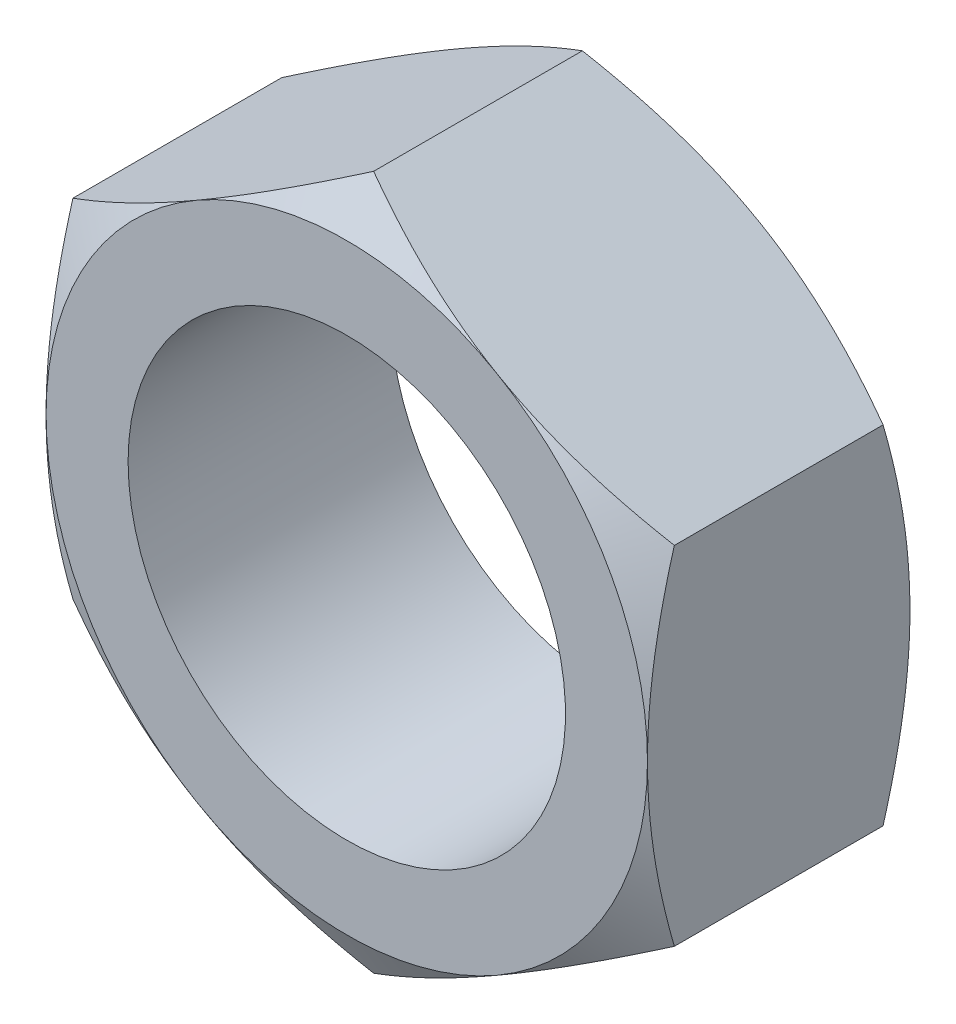
ISO-10303-21;
HEADER;
FILE_DESCRIPTION(('STEP AP214'),'2;1');
FILE_NAME('part.step','',(''),(''),'','','');
FILE_SCHEMA(('AUTOMOTIVE_DESIGN { 1 0 10303 214 1 1 1 1 }'));
ENDSEC;
DATA;
#1=APPLICATION_CONTEXT('core data for automotive mechanical design processes');
#2=APPLICATION_PROTOCOL_DEFINITION('international standard','automotive_design',2000,#1);
#3=PRODUCT_CONTEXT('',#1,'mechanical');
#4=PRODUCT('Part','Part','',(#3));
#5=PRODUCT_RELATED_PRODUCT_CATEGORY('part','',(#4));
#6=PRODUCT_DEFINITION_FORMATION('','',#4);
#7=PRODUCT_DEFINITION_CONTEXT('part definition',#1,'design');
#8=PRODUCT_DEFINITION('design','',#6,#7);
#9=PRODUCT_DEFINITION_SHAPE('','',#8);
#10=(LENGTH_UNIT() NAMED_UNIT(*) SI_UNIT(.MILLI.,.METRE.));
#11=(NAMED_UNIT(*) PLANE_ANGLE_UNIT() SI_UNIT($,.RADIAN.));
#12=(NAMED_UNIT(*) SI_UNIT($,.STERADIAN.) SOLID_ANGLE_UNIT());
#13=UNCERTAINTY_MEASURE_WITH_UNIT(LENGTH_MEASURE(1.E-05),#10,'distance_accuracy_value','');
#14=(GEOMETRIC_REPRESENTATION_CONTEXT(3) GLOBAL_UNCERTAINTY_ASSIGNED_CONTEXT((#13)) GLOBAL_UNIT_ASSIGNED_CONTEXT((#10,
#11,#12)) REPRESENTATION_CONTEXT('',''));
#15=CARTESIAN_POINT('',(0.,0.,0.));
#16=DIRECTION('',(0.,0.,1.));
#17=DIRECTION('',(1.,0.,0.));
#18=AXIS2_PLACEMENT_3D('',#15,#16,#17);
#19=CARTESIAN_POINT('',(0.,3.17542648054295,-2.4));
#20=DIRECTION('',(0.,0.,-1.));
#21=DIRECTION('',(-1.,0.,0.));
#22=AXIS2_PLACEMENT_3D('',#19,#20,#21);
#23=PLANE('',#22);
#24=CARTESIAN_POINT('',(0.,0.,-2.4));
#25=DIRECTION('',(0.,0.,-1.));
#26=DIRECTION('',(-1.,0.,0.));
#27=AXIS2_PLACEMENT_3D('',#24,#25,#26);
#28=CIRCLE('',#27,2.);
#29=CARTESIAN_POINT('',(-2.,0.,-2.4));
#30=VERTEX_POINT('',#29);
#31=EDGE_CURVE('E317',#30,#30,#28,.T.);
#32=ORIENTED_EDGE('',*,*,#31,.F.);
#33=EDGE_LOOP('',(#32));
#34=FACE_BOUND('',#33,.T.);
#35=CARTESIAN_POINT('',(0.,0.,-2.4));
#36=DIRECTION('',(0.,0.,-1.));
#37=DIRECTION('',(-1.,0.,0.));
#38=AXIS2_PLACEMENT_3D('',#35,#36,#37);
#39=CIRCLE('',#38,2.75);
#40=CARTESIAN_POINT('',(-2.75,0.,-2.4));
#41=VERTEX_POINT('',#40);
#42=CARTESIAN_POINT('',(-1.37500000000002,-2.3815698604072,-2.4));
#43=VERTEX_POINT('',#42);
#44=EDGE_CURVE('E171',#41,#43,#39,.F.);
#45=ORIENTED_EDGE('',*,*,#44,.F.);
#46=CARTESIAN_POINT('',(-1.37500000000001,2.3815698604072,-2.4));
#47=VERTEX_POINT('',#46);
#48=EDGE_CURVE('E153',#47,#41,#39,.F.);
#49=ORIENTED_EDGE('',*,*,#48,.F.);
#50=CARTESIAN_POINT('',(1.37500000000002,2.38156986040719,-2.4));
#51=VERTEX_POINT('',#50);
#52=EDGE_CURVE('E170',#51,#47,#39,.F.);
#53=ORIENTED_EDGE('',*,*,#52,.F.);
#54=CARTESIAN_POINT('',(0.,0.,-2.4));
#55=DIRECTION('',(0.,0.,1.));
#56=DIRECTION('',(1.,0.,0.));
#57=AXIS2_PLACEMENT_3D('',#54,#55,#56);
#58=CIRCLE('',#57,2.75);
#59=CARTESIAN_POINT('',(2.75,0.,-2.4));
#60=VERTEX_POINT('',#59);
#61=EDGE_CURVE('E305',#60,#51,#58,.T.);
#62=ORIENTED_EDGE('',*,*,#61,.F.);
#63=CARTESIAN_POINT('',(1.375,-2.3815698604072,-2.4));
#64=VERTEX_POINT('',#63);
#65=EDGE_CURVE('E185',#64,#60,#39,.F.);
#66=ORIENTED_EDGE('',*,*,#65,.F.);
#67=EDGE_CURVE('E180',#43,#64,#39,.F.);
#68=ORIENTED_EDGE('',*,*,#67,.F.);
#69=EDGE_LOOP('',(#45,#49,#53,#62,#66,#68));
#70=FACE_BOUND('',#69,.T.);
#71=ADVANCED_FACE('F36',(#34,#70),#23,.T.);
#72=CARTESIAN_POINT('',(0.,3.17542648054295,0.));
#73=DIRECTION('',(0.,0.,-1.));
#74=DIRECTION('',(-1.,0.,0.));
#75=AXIS2_PLACEMENT_3D('',#72,#73,#74);
#76=PLANE('',#75);
#77=CARTESIAN_POINT('',(0.,0.,0.));
#78=DIRECTION('',(0.,0.,-1.));
#79=DIRECTION('',(-1.,0.,0.));
#80=AXIS2_PLACEMENT_3D('',#77,#78,#79);
#81=CIRCLE('',#80,2.);
#82=CARTESIAN_POINT('',(-2.,0.,0.));
#83=VERTEX_POINT('',#82);
#84=EDGE_CURVE('E41',#83,#83,#81,.T.);
#85=ORIENTED_EDGE('',*,*,#84,.T.);
#86=EDGE_LOOP('',(#85));
#87=FACE_BOUND('',#86,.T.);
#88=CARTESIAN_POINT('',(0.,0.,0.));
#89=DIRECTION('',(0.,0.,-1.));
#90=DIRECTION('',(-1.,0.,0.));
#91=AXIS2_PLACEMENT_3D('',#88,#89,#90);
#92=CIRCLE('',#91,2.75);
#93=CARTESIAN_POINT('',(-2.75,0.,0.));
#94=VERTEX_POINT('',#93);
#95=CARTESIAN_POINT('',(-1.37500000000001,2.3815698604072,0.));
#96=VERTEX_POINT('',#95);
#97=EDGE_CURVE('E11',#94,#96,#92,.T.);
#98=ORIENTED_EDGE('',*,*,#97,.F.);
#99=CARTESIAN_POINT('',(-1.37500000000002,-2.3815698604072,0.));
#100=VERTEX_POINT('',#99);
#101=EDGE_CURVE('E47',#100,#94,#92,.T.);
#102=ORIENTED_EDGE('',*,*,#101,.F.);
#103=CARTESIAN_POINT('',(1.375,-2.3815698604072,0.));
#104=VERTEX_POINT('',#103);
#105=EDGE_CURVE('E173',#104,#100,#92,.T.);
#106=ORIENTED_EDGE('',*,*,#105,.F.);
#107=CARTESIAN_POINT('',(2.75,0.,0.));
#108=VERTEX_POINT('',#107);
#109=EDGE_CURVE('E178',#108,#104,#92,.T.);
#110=ORIENTED_EDGE('',*,*,#109,.F.);
#111=CARTESIAN_POINT('',(0.,0.,0.));
#112=DIRECTION('',(0.,0.,1.));
#113=DIRECTION('',(1.,0.,0.));
#114=AXIS2_PLACEMENT_3D('',#111,#112,#113);
#115=CIRCLE('',#114,2.75);
#116=CARTESIAN_POINT('',(1.37500000000002,2.38156986040719,0.));
#117=VERTEX_POINT('',#116);
#118=EDGE_CURVE('E129',#108,#117,#115,.T.);
#119=ORIENTED_EDGE('',*,*,#118,.T.);
#120=EDGE_CURVE('E46',#96,#117,#92,.T.);
#121=ORIENTED_EDGE('',*,*,#120,.F.);
#122=EDGE_LOOP('',(#98,#102,#106,#110,#119,#121));
#123=FACE_BOUND('',#122,.T.);
#124=ADVANCED_FACE('F239',(#87,#123),#76,.F.);
#125=CARTESIAN_POINT('',(0.,3.17542648054295,-2.4));
#126=DIRECTION('',(-0.500000000000004,0.866025403784436,0.));
#127=DIRECTION('',(-0.866025403784437,-0.500000000000004,0.));
#128=AXIS2_PLACEMENT_3D('',#125,#126,#127);
#129=PLANE('',#128);
#130=DIRECTION('',(0.,0.,1.));
#131=VECTOR('',#130,1.);
#132=CARTESIAN_POINT('',(-2.75,1.58771324027146,-2.4));
#133=LINE('',#132,#131);
#134=CARTESIAN_POINT('',(-2.75,1.58771324027149,-2.15437990693813));
#135=VERTEX_POINT('',#134);
#136=CARTESIAN_POINT('',(-2.75,1.58771324027146,-0.245620093061863));
#137=VERTEX_POINT('',#136);
#138=EDGE_CURVE('E165',#135,#137,#133,.T.);
#139=ORIENTED_EDGE('',*,*,#138,.T.);
#140=CARTESIAN_POINT('',(-2.7502,1.58759777021762,-0.245686763364762));
#141=CARTESIAN_POINT('',(-2.62935077934009,1.65737010029698,-0.205387662249264));
#142=CARTESIAN_POINT('',(-2.50745839737737,1.72774469983532,-0.168736902597662));
#143=CARTESIAN_POINT('',(-2.26156287327211,1.86971254687002,-0.1047621829698));
#144=CARTESIAN_POINT('',(-2.13755536142614,1.94130831721582,-0.0774608556744958));
#145=CARTESIAN_POINT('',(-1.89107720202406,2.08361254889598,-0.0349617452941147));
#146=CARTESIAN_POINT('',(-1.76864448141258,2.15429911309863,-0.0194811186224557));
#147=CARTESIAN_POINT('',(-1.52320285763109,2.29600490065922,-0.000999397369938647));
#148=CARTESIAN_POINT('',(-1.40019484676709,2.36702360884403,0.00201700053740192));
#149=CARTESIAN_POINT('',(-1.17034121338921,2.49972966594897,-0.0042531454285456));
#150=CARTESIAN_POINT('',(-1.06346120874598,2.56143686540072,-0.0120001542767017));
#151=CARTESIAN_POINT('',(-0.850397532665248,2.68444923614047,-0.0365551810643555));
#152=CARTESIAN_POINT('',(-0.744214598351108,2.74575398185008,-0.0533715896505721));
#153=CARTESIAN_POINT('',(-0.530711510606812,2.86902004703207,-0.0954119223459602));
#154=CARTESIAN_POINT('',(-0.423418383857139,2.93096576264319,-0.120814080687236));
#155=CARTESIAN_POINT('',(-0.210432520715941,3.05393320806134,-0.178467225839989));
#156=CARTESIAN_POINT('',(-0.104737054973339,3.11495651365996,-0.210704663298991));
#157=CARTESIAN_POINT('',(0.000200000000009052,3.17554195059679,-0.245686763364771));
#158=B_SPLINE_CURVE_WITH_KNOTS('',3,(#140,#141,#142,#143,#144,#145,#146,#147,#148,#149,#150,
#151,#152,#153,#154,#155,#156,#157),.UNSPECIFIED.,.F.,.F.,(4,2,2,2,2,2,2,2,4),(0.,
0.435912828725888,0.872873557116333,1.29901931904672,1.72464171213574,2.09526089052938,
2.46622354066375,2.84541551798559,3.22386274754526),.UNSPECIFIED.);
#159=EDGE_CURVE('E134',#137,#96,#158,.T.);
#160=ORIENTED_EDGE('',*,*,#159,.T.);
#161=CARTESIAN_POINT('',(0.,3.17542648054295,-0.245620093061873));
#162=VERTEX_POINT('',#161);
#163=EDGE_CURVE('E54',#96,#162,#158,.T.);
#164=ORIENTED_EDGE('',*,*,#163,.T.);
#165=DIRECTION('',(0.,0.,1.));
#166=VECTOR('',#165,1.);
#167=CARTESIAN_POINT('',(0.,3.17542648054295,-2.4));
#168=LINE('',#167,#166);
#169=CARTESIAN_POINT('',(0.,3.17542648054295,-2.15437990693813));
#170=VERTEX_POINT('',#169);
#171=EDGE_CURVE('E150',#170,#162,#168,.T.);
#172=ORIENTED_EDGE('',*,*,#171,.F.);
#173=CARTESIAN_POINT('',(-2.7502,1.58759777021762,-2.15431323663524));
#174=CARTESIAN_POINT('',(-2.62935077934009,1.65737010029698,-2.19461233775074));
#175=CARTESIAN_POINT('',(-2.50745839737737,1.72774469983532,-2.23126309740234));
#176=CARTESIAN_POINT('',(-2.26156287327211,1.86971254687002,-2.2952378170302));
#177=CARTESIAN_POINT('',(-2.13755536142614,1.94130831721582,-2.3225391443255));
#178=CARTESIAN_POINT('',(-1.89107720202406,2.08361254889598,-2.36503825470588));
#179=CARTESIAN_POINT('',(-1.76864448141258,2.15429911309863,-2.38051888137754));
#180=CARTESIAN_POINT('',(-1.52320285763109,2.29600490065922,-2.39900060263006));
#181=CARTESIAN_POINT('',(-1.40019484676709,2.36702360884403,-2.4020170005374));
#182=CARTESIAN_POINT('',(-1.17034121338921,2.49972966594897,-2.39574685457145));
#183=CARTESIAN_POINT('',(-1.06346120874598,2.56143686540072,-2.3879998457233));
#184=CARTESIAN_POINT('',(-0.850397532665248,2.68444923614047,-2.36344481893564));
#185=CARTESIAN_POINT('',(-0.744214598351108,2.74575398185008,-2.34662841034943));
#186=CARTESIAN_POINT('',(-0.530711510606812,2.86902004703207,-2.30458807765404));
#187=CARTESIAN_POINT('',(-0.423418383857139,2.93096576264319,-2.27918591931276));
#188=CARTESIAN_POINT('',(-0.210432520715941,3.05393320806134,-2.22153277416001));
#189=CARTESIAN_POINT('',(-0.104737054973339,3.11495651365996,-2.18929533670101));
#190=CARTESIAN_POINT('',(0.00020000000000905,3.17554195059679,-2.15431323663523));
#191=B_SPLINE_CURVE_WITH_KNOTS('',3,(#173,#174,#175,#176,#177,#178,#179,#180,#181,#182,#183,
#184,#185,#186,#187,#188,#189,#190),.UNSPECIFIED.,.F.,.F.,(4,2,2,2,2,2,2,2,4),(0.,
0.435912828725889,0.872873557116333,1.29901931904672,1.72464171213574,2.09526089052938,
2.46622354066375,2.84541551798559,3.22386274754526),.UNSPECIFIED.);
#192=EDGE_CURVE('E168',#47,#170,#191,.T.);
#193=ORIENTED_EDGE('',*,*,#192,.F.);
#194=EDGE_CURVE('E203',#135,#47,#191,.T.);
#195=ORIENTED_EDGE('',*,*,#194,.F.);
#196=EDGE_LOOP('',(#139,#160,#164,#172,#193,#195));
#197=FACE_BOUND('',#196,.T.);
#198=ADVANCED_FACE('F38',(#197),#129,.T.);
#199=CARTESIAN_POINT('',(2.75,1.58771324027145,-2.4));
#200=DIRECTION('',(0.500000000000009,0.866025403784433,0.));
#201=DIRECTION('',(-0.866025403784434,0.500000000000009,0.));
#202=AXIS2_PLACEMENT_3D('',#199,#200,#201);
#203=PLANE('',#202);
#204=ORIENTED_EDGE('',*,*,#171,.T.);
#205=CARTESIAN_POINT('',(-0.000199999999990853,3.17554195059679,-0.245686763364771));
#206=CARTESIAN_POINT('',(0.120649220659915,3.10576962051743,-0.205387662249272));
#207=CARTESIAN_POINT('',(0.242541602622642,3.03539502097909,-0.16873690259767));
#208=CARTESIAN_POINT('',(0.488437126727901,2.89342717394439,-0.104762182969806));
#209=CARTESIAN_POINT('',(0.612444638573863,2.82183140359859,-0.0774608556745011));
#210=CARTESIAN_POINT('',(0.858922797975952,2.67952717191842,-0.0349617452941182));
#211=CARTESIAN_POINT('',(0.981355518587425,2.60884060771577,-0.0194811186224581));
#212=CARTESIAN_POINT('',(1.22679714236892,2.46713482015518,-0.000999397369939154));
#213=CARTESIAN_POINT('',(1.34980515323292,2.39611611197037,0.00201700053740218));
#214=CARTESIAN_POINT('',(1.5796587866108,2.26341005486543,-0.00425314542854392));
#215=CARTESIAN_POINT('',(1.68653879125403,2.20170285541367,-0.0120001542766992));
#216=CARTESIAN_POINT('',(1.89960246733476,2.07869048467393,-0.0365551810643514));
#217=CARTESIAN_POINT('',(2.00578540164889,2.01738573896432,-0.053371589650567));
#218=CARTESIAN_POINT('',(2.21928848939319,1.89411967378233,-0.0954119223459534));
#219=CARTESIAN_POINT('',(2.32658161614286,1.83217395817121,-0.120814080687228));
#220=CARTESIAN_POINT('',(2.53956747928405,1.70920651275305,-0.17846722583998));
#221=CARTESIAN_POINT('',(2.64526294502666,1.64818320715444,-0.210704663298981));
#222=CARTESIAN_POINT('',(2.7502,1.58759777021761,-0.245686763364759));
#223=B_SPLINE_CURVE_WITH_KNOTS('',3,(#205,#206,#207,#208,#209,#210,#211,#212,#213,#214,#215,
#216,#217,#218,#219,#220,#221,#222),.UNSPECIFIED.,.F.,.F.,(4,2,2,2,2,2,2,2,4),(0.,
0.435912828725891,0.872873557116338,1.29901931904672,1.72464171213575,2.09526089052939,
2.46622354066375,2.84541551798559,3.22386274754526),.UNSPECIFIED.);
#224=EDGE_CURVE('E144',#162,#117,#223,.T.);
#225=ORIENTED_EDGE('',*,*,#224,.T.);
#226=CARTESIAN_POINT('',(2.75,1.58771324027149,-0.245620093061873));
#227=VERTEX_POINT('',#226);
#228=EDGE_CURVE('E61',#117,#227,#223,.T.);
#229=ORIENTED_EDGE('',*,*,#228,.T.);
#230=DIRECTION('',(0.,0.,1.));
#231=VECTOR('',#230,1.);
#232=CARTESIAN_POINT('',(2.75,1.58771324027145,-2.4));
#233=LINE('',#232,#231);
#234=CARTESIAN_POINT('',(2.75,1.58771324027149,-2.15437990693813));
#235=VERTEX_POINT('',#234);
#236=EDGE_CURVE('E143',#235,#227,#233,.T.);
#237=ORIENTED_EDGE('',*,*,#236,.F.);
#238=CARTESIAN_POINT('',(-0.000199999999990853,3.17554195059679,-2.15431323663523));
#239=CARTESIAN_POINT('',(0.120649220659915,3.10576962051743,-2.19461233775073));
#240=CARTESIAN_POINT('',(0.242541602622642,3.03539502097909,-2.23126309740233));
#241=CARTESIAN_POINT('',(0.488437126727901,2.89342717394439,-2.29523781703019));
#242=CARTESIAN_POINT('',(0.612444638573863,2.82183140359859,-2.3225391443255));
#243=CARTESIAN_POINT('',(0.858922797975952,2.67952717191842,-2.36503825470588));
#244=CARTESIAN_POINT('',(0.981355518587425,2.60884060771577,-2.38051888137754));
#245=CARTESIAN_POINT('',(1.22679714236892,2.46713482015518,-2.39900060263006));
#246=CARTESIAN_POINT('',(1.34980515323292,2.39611611197037,-2.4020170005374));
#247=CARTESIAN_POINT('',(1.5796587866108,2.26341005486543,-2.39574685457146));
#248=CARTESIAN_POINT('',(1.68653879125403,2.20170285541367,-2.3879998457233));
#249=CARTESIAN_POINT('',(1.89960246733476,2.07869048467393,-2.36344481893565));
#250=CARTESIAN_POINT('',(2.00578540164889,2.01738573896432,-2.34662841034943));
#251=CARTESIAN_POINT('',(2.21928848939319,1.89411967378233,-2.30458807765405));
#252=CARTESIAN_POINT('',(2.32658161614286,1.83217395817121,-2.27918591931277));
#253=CARTESIAN_POINT('',(2.53956747928406,1.70920651275305,-2.22153277416002));
#254=CARTESIAN_POINT('',(2.64526294502666,1.64818320715444,-2.18929533670102));
#255=CARTESIAN_POINT('',(2.7502,1.58759777021761,-2.15431323663524));
#256=B_SPLINE_CURVE_WITH_KNOTS('',3,(#238,#239,#240,#241,#242,#243,#244,#245,#246,#247,#248,
#249,#250,#251,#252,#253,#254,#255),.UNSPECIFIED.,.F.,.F.,(4,2,2,2,2,2,2,2,4),(0.,
0.435912828725891,0.872873557116338,1.29901931904672,1.72464171213575,2.09526089052939,
2.46622354066375,2.84541551798559,3.22386274754526),.UNSPECIFIED.);
#257=EDGE_CURVE('E212',#51,#235,#256,.T.);
#258=ORIENTED_EDGE('',*,*,#257,.F.);
#259=EDGE_CURVE('E197',#170,#51,#256,.T.);
#260=ORIENTED_EDGE('',*,*,#259,.F.);
#261=EDGE_LOOP('',(#204,#225,#229,#237,#258,#260));
#262=FACE_BOUND('',#261,.T.);
#263=ADVANCED_FACE('F141',(#262),#203,.T.);
#264=CARTESIAN_POINT('',(2.75,1.58771324027145,-2.4));
#265=DIRECTION('',(-1.,0.,0.));
#266=DIRECTION('',(0.,0.,1.));
#267=AXIS2_PLACEMENT_3D('',#264,#265,#266);
#268=PLANE('',#267);
#269=CARTESIAN_POINT('',(2.75,-4.2108494930968,-1.31594843960298));
#270=CARTESIAN_POINT('',(2.75,-4.09010894214094,-1.25759993615228));
#271=CARTESIAN_POINT('',(2.75,-3.96908292065513,-1.19983146511762));
#272=CARTESIAN_POINT('',(2.75,-3.72630558284848,-1.08578603842309));
#273=CARTESIAN_POINT('',(2.75,-3.60455414536204,-1.02950934100251));
#274=CARTESIAN_POINT('',(2.75,-3.35951393034358,-0.91848244335279));
#275=CARTESIAN_POINT('',(2.75,-3.2362203423644,-0.86374282160587));
#276=CARTESIAN_POINT('',(2.75,-2.98861980138747,-0.756614777476483));
#277=CARTESIAN_POINT('',(2.75,-2.86431290161186,-0.704226232536791));
#278=CARTESIAN_POINT('',(2.75,-2.61294485887175,-0.601803572146148));
#279=CARTESIAN_POINT('',(2.75,-2.48586863815658,-0.551806257898417));
#280=CARTESIAN_POINT('',(2.75,-2.23021732171544,-0.455727408784622));
#281=CARTESIAN_POINT('',(2.75,-2.10164206103367,-0.409646309576991));
#282=CARTESIAN_POINT('',(2.75,-1.8430521879947,-0.322638077046248));
#283=CARTESIAN_POINT('',(2.75,-1.71304130052586,-0.281699986413904));
#284=CARTESIAN_POINT('',(2.75,-1.45117125062151,-0.206307307624361));
#285=CARTESIAN_POINT('',(2.75,-1.31931268690205,-0.171850669152779));
#286=CARTESIAN_POINT('',(2.75,-1.05365722480015,-0.111093671530913));
#287=CARTESIAN_POINT('',(2.75,-0.919859820217618,-0.0847954840951296));
#288=CARTESIAN_POINT('',(2.75,-0.650651874037407,-0.0421260371966173));
#289=CARTESIAN_POINT('',(2.75,-0.51524133101362,-0.0257547865105482));
#290=CARTESIAN_POINT('',(2.75,-0.244373242869234,-0.00438749654024083));
#291=CARTESIAN_POINT('',(2.75,-0.108921526377156,0.000680556773213286));
#292=CARTESIAN_POINT('',(2.75,0.161887058855113,-0.000827795632673346));
#293=CARTESIAN_POINT('',(2.75,0.297243943089621,-0.00740117868555447));
#294=CARTESIAN_POINT('',(2.75,0.528385436717521,-0.0281041300468438));
#295=CARTESIAN_POINT('',(2.75,0.624425050137477,-0.0395376410301878));
#296=CARTESIAN_POINT('',(2.75,0.815762399811515,-0.0675217196133493));
#297=CARTESIAN_POINT('',(2.75,0.911060016631936,-0.08407309422768));
#298=CARTESIAN_POINT('',(2.75,1.19576218748913,-0.14053536127828));
#299=CARTESIAN_POINT('',(2.75,1.38383224738492,-0.187239859417288));
#300=CARTESIAN_POINT('',(2.75,1.6652504894748,-0.26779249703057));
#301=CARTESIAN_POINT('',(2.75,1.76006556248553,-0.296803334995491));
#302=CARTESIAN_POINT('',(2.75,1.9487060938221,-0.357695648906576));
#303=CARTESIAN_POINT('',(2.75,2.0425321855369,-0.389575144878491));
#304=CARTESIAN_POINT('',(2.75,2.22880240354978,-0.455541418186435));
#305=CARTESIAN_POINT('',(2.75,2.32125133588445,-0.489614761455518));
#306=CARTESIAN_POINT('',(2.75,2.50543192042622,-0.559761368231093));
#307=CARTESIAN_POINT('',(2.75,2.59716326539572,-0.595835440037301));
#308=CARTESIAN_POINT('',(2.75,2.68856293053338,-0.632712441997466));
#309=B_SPLINE_CURVE_WITH_KNOTS('',3,(#269,#270,#271,#272,#273,#274,#275,#276,#277,#278,#279,
#280,#281,#282,#283,#284,#285,#286,#287,#288,#289,#290,#291,#292,#293,#294,#295,#296,#297,#298,
#299,#300,#301,#302,#303,#304,#305,#306,#307,#308),.UNSPECIFIED.,.F.,.F.,(4,2,2,2,2,2,2,2,2,2,2,
2,2,2,2,2,2,2,2,4),(0.,0.402305607365938,0.804680408537001,1.20935783819119,1.61401414820819,
2.02363838185771,2.4333081245735,2.84208969479602,3.25074173456638,3.65950246109146,
4.06826354901186,4.47441284024653,4.88045669141175,5.17046846817548,5.46052599902454,
6.04107275309883,6.33851131304661,6.63574613017454,6.9313079100579,7.2269899800482),.UNSPECIFIED.);
#310=CARTESIAN_POINT('',(2.74999999999999,-1.58771324027152,-0.245620093061873));
#311=VERTEX_POINT('',#310);
#312=EDGE_CURVE('E136',#311,#108,#309,.T.);
#313=ORIENTED_EDGE('',*,*,#312,.F.);
#314=DIRECTION('',(0.,0.,1.));
#315=VECTOR('',#314,1.);
#316=CARTESIAN_POINT('',(2.75,-1.58771324027151,-2.4));
#317=LINE('',#316,#315);
#318=CARTESIAN_POINT('',(2.74999999999999,-1.58771324027152,-2.15437990693813));
#319=VERTEX_POINT('',#318);
#320=EDGE_CURVE('E151',#319,#311,#317,.T.);
#321=ORIENTED_EDGE('',*,*,#320,.F.);
#322=CARTESIAN_POINT('',(2.75,-4.2108494930968,-1.08405156039702));
#323=CARTESIAN_POINT('',(2.75,-4.09010894214094,-1.14240006384772));
#324=CARTESIAN_POINT('',(2.75,-3.96908292065513,-1.20016853488238));
#325=CARTESIAN_POINT('',(2.75,-3.72630558284848,-1.31421396157691));
#326=CARTESIAN_POINT('',(2.75,-3.60455414536204,-1.37049065899749));
#327=CARTESIAN_POINT('',(2.75,-3.35951393034358,-1.48151755664721));
#328=CARTESIAN_POINT('',(2.75,-3.2362203423644,-1.53625717839413));
#329=CARTESIAN_POINT('',(2.75,-2.98861980138747,-1.64338522252352));
#330=CARTESIAN_POINT('',(2.75,-2.86431290161186,-1.69577376746321));
#331=CARTESIAN_POINT('',(2.75,-2.61294485887176,-1.79819642785385));
#332=CARTESIAN_POINT('',(2.75,-2.48586863815658,-1.84819374210158));
#333=CARTESIAN_POINT('',(2.75,-2.23021732171544,-1.94427259121538));
#334=CARTESIAN_POINT('',(2.75,-2.10164206103367,-1.99035369042301));
#335=CARTESIAN_POINT('',(2.75,-1.8430521879947,-2.07736192295375));
#336=CARTESIAN_POINT('',(2.75,-1.71304130052586,-2.1183000135861));
#337=CARTESIAN_POINT('',(2.75,-1.45117125062151,-2.19369269237564));
#338=CARTESIAN_POINT('',(2.75,-1.31931268690205,-2.22814933084722));
#339=CARTESIAN_POINT('',(2.75,-1.05365722480015,-2.28890632846909));
#340=CARTESIAN_POINT('',(2.75,-0.919859820217618,-2.31520451590487));
#341=CARTESIAN_POINT('',(2.75,-0.650651874037407,-2.35787396280338));
#342=CARTESIAN_POINT('',(2.75,-0.515241331013619,-2.37424521348945));
#343=CARTESIAN_POINT('',(2.75,-0.244373242869234,-2.39561250345976));
#344=CARTESIAN_POINT('',(2.75,-0.108921526377155,-2.40068055677321));
#345=CARTESIAN_POINT('',(2.75,0.161887058855114,-2.39917220436733));
#346=CARTESIAN_POINT('',(2.75,0.297243943089621,-2.39259882131445));
#347=CARTESIAN_POINT('',(2.75,0.528385436717521,-2.37189586995316));
#348=CARTESIAN_POINT('',(2.75,0.624425050137477,-2.36046235896981));
#349=CARTESIAN_POINT('',(2.75,0.815762399811515,-2.33247828038665));
#350=CARTESIAN_POINT('',(2.75,0.911060016631935,-2.31592690577232));
#351=CARTESIAN_POINT('',(2.75,1.19576218748913,-2.25946463872172));
#352=CARTESIAN_POINT('',(2.75,1.38383224738492,-2.21276014058271));
#353=CARTESIAN_POINT('',(2.75,1.6652504894748,-2.13220750296943));
#354=CARTESIAN_POINT('',(2.75,1.76006556248553,-2.10319666500451));
#355=CARTESIAN_POINT('',(2.75,1.9487060938221,-2.04230435109342));
#356=CARTESIAN_POINT('',(2.75,2.0425321855369,-2.01042485512151));
#357=CARTESIAN_POINT('',(2.75,2.22880240354978,-1.94445858181357));
#358=CARTESIAN_POINT('',(2.75,2.32125133588445,-1.91038523854448));
#359=CARTESIAN_POINT('',(2.75,2.50543192042622,-1.84023863176891));
#360=CARTESIAN_POINT('',(2.75,2.59716326539572,-1.8041645599627));
#361=CARTESIAN_POINT('',(2.75,2.68856293053338,-1.76728755800253));
#362=B_SPLINE_CURVE_WITH_KNOTS('',3,(#322,#323,#324,#325,#326,#327,#328,#329,#330,#331,#332,
#333,#334,#335,#336,#337,#338,#339,#340,#341,#342,#343,#344,#345,#346,#347,#348,#349,#350,#351,
#352,#353,#354,#355,#356,#357,#358,#359,#360,#361),.UNSPECIFIED.,.F.,.F.,(4,2,2,2,2,2,2,2,2,2,2,
2,2,2,2,2,2,2,2,4),(0.,0.402305607365938,0.804680408537,1.20935783819119,1.61401414820819,
2.02363838185771,2.4333081245735,2.84208969479602,3.25074173456638,3.65950246109146,
4.06826354901186,4.47441284024653,4.88045669141175,5.17046846817548,5.46052599902454,
6.04107275309883,6.33851131304661,6.63574613017454,6.9313079100579,7.2269899800482),.UNSPECIFIED.);
#363=EDGE_CURVE('E209',#319,#60,#362,.T.);
#364=ORIENTED_EDGE('',*,*,#363,.T.);
#365=EDGE_CURVE('E149',#60,#235,#362,.T.);
#366=ORIENTED_EDGE('',*,*,#365,.T.);
#367=ORIENTED_EDGE('',*,*,#236,.T.);
#368=EDGE_CURVE('E126',#108,#227,#309,.T.);
#369=ORIENTED_EDGE('',*,*,#368,.F.);
#370=EDGE_LOOP('',(#313,#321,#364,#366,#367,#369));
#371=FACE_BOUND('',#370,.T.);
#372=ADVANCED_FACE('F147',(#371),#268,.F.);
#373=CARTESIAN_POINT('',(0.,-3.17542648054299,-2.4));
#374=DIRECTION('',(0.500000000000002,-0.866025403784438,0.));
#375=DIRECTION('',(0.866025403784438,0.500000000000002,0.));
#376=AXIS2_PLACEMENT_3D('',#373,#374,#375);
#377=PLANE('',#376);
#378=ORIENTED_EDGE('',*,*,#320,.T.);
#379=CARTESIAN_POINT('',(2.7502,-1.58759777021767,-0.245686763364776));
#380=CARTESIAN_POINT('',(2.6293507793401,-1.65737010029702,-0.205387662249279));
#381=CARTESIAN_POINT('',(2.50745839737737,-1.72774469983537,-0.168736902597678));
#382=CARTESIAN_POINT('',(2.26156287327211,-1.86971254687006,-0.104762182969816));
#383=CARTESIAN_POINT('',(2.13755536142614,-1.94130831721587,-0.0774608556745132));
#384=CARTESIAN_POINT('',(1.89107720202405,-2.08361254889603,-0.0349617452941333));
#385=CARTESIAN_POINT('',(1.76864448141258,-2.15429911309868,-0.0194811186224748));
#386=CARTESIAN_POINT('',(1.52320285763108,-2.29600490065927,-0.000999397369959041));
#387=CARTESIAN_POINT('',(1.40019484676708,-2.36702360884408,0.00201700053738056));
#388=CARTESIAN_POINT('',(1.1703412133892,-2.49972966594901,-0.00425314542856851));
#389=CARTESIAN_POINT('',(1.06346120874597,-2.56143686540077,-0.012000154276725));
#390=CARTESIAN_POINT('',(0.850397532665243,-2.68444923614051,-0.0365551810643791));
#391=CARTESIAN_POINT('',(0.744214598351104,-2.74575398185012,-0.0533715896505955));
#392=CARTESIAN_POINT('',(0.530711510606811,-2.86902004703211,-0.0954119223459832));
#393=CARTESIAN_POINT('',(0.42341838385714,-2.93096576264323,-0.120814080687258));
#394=CARTESIAN_POINT('',(0.210432520715946,-3.05393320806138,-0.178467225840011));
#395=CARTESIAN_POINT('',(0.104737054973345,-3.11495651366,-0.210704663299012));
#396=CARTESIAN_POINT('',(-0.000200000000002151,-3.17554195059682,-0.245686763364791));
#397=B_SPLINE_CURVE_WITH_KNOTS('',3,(#379,#380,#381,#382,#383,#384,#385,#386,#387,#388,#389,
#390,#391,#392,#393,#394,#395,#396),.UNSPECIFIED.,.F.,.F.,(4,2,2,2,2,2,2,2,4),(0.,
0.435912828725892,0.872873557116341,1.29901931904673,1.72464171213575,2.09526089052939,
2.46622354066376,2.84541551798558,3.22386274754525),.UNSPECIFIED.);
#398=EDGE_CURVE('E283',#311,#104,#397,.T.);
#399=ORIENTED_EDGE('',*,*,#398,.T.);
#400=CARTESIAN_POINT('',(0.,-3.17542648054295,-0.245620093061873));
#401=VERTEX_POINT('',#400);
#402=EDGE_CURVE('E276',#104,#401,#397,.T.);
#403=ORIENTED_EDGE('',*,*,#402,.T.);
#404=DIRECTION('',(0.,0.,1.));
#405=VECTOR('',#404,1.);
#406=CARTESIAN_POINT('',(0.,-3.17542648054299,-2.4));
#407=LINE('',#406,#405);
#408=CARTESIAN_POINT('',(0.,-3.17542648054295,-2.15437990693813));
#409=VERTEX_POINT('',#408);
#410=EDGE_CURVE('E156',#409,#401,#407,.T.);
#411=ORIENTED_EDGE('',*,*,#410,.F.);
#412=CARTESIAN_POINT('',(2.7502,-1.58759777021767,-2.15431323663522));
#413=CARTESIAN_POINT('',(2.6293507793401,-1.65737010029702,-2.19461233775072));
#414=CARTESIAN_POINT('',(2.50745839737737,-1.72774469983537,-2.23126309740232));
#415=CARTESIAN_POINT('',(2.26156287327211,-1.86971254687006,-2.29523781703018));
#416=CARTESIAN_POINT('',(2.13755536142614,-1.94130831721587,-2.32253914432549));
#417=CARTESIAN_POINT('',(1.89107720202405,-2.08361254889603,-2.36503825470587));
#418=CARTESIAN_POINT('',(1.76864448141258,-2.15429911309868,-2.38051888137752));
#419=CARTESIAN_POINT('',(1.52320285763108,-2.29600490065927,-2.39900060263004));
#420=CARTESIAN_POINT('',(1.40019484676708,-2.36702360884408,-2.40201700053738));
#421=CARTESIAN_POINT('',(1.1703412133892,-2.49972966594901,-2.39574685457143));
#422=CARTESIAN_POINT('',(1.06346120874597,-2.56143686540077,-2.38799984572327));
#423=CARTESIAN_POINT('',(0.850397532665243,-2.68444923614051,-2.36344481893562));
#424=CARTESIAN_POINT('',(0.744214598351104,-2.74575398185012,-2.3466284103494));
#425=CARTESIAN_POINT('',(0.530711510606811,-2.86902004703211,-2.30458807765402));
#426=CARTESIAN_POINT('',(0.42341838385714,-2.93096576264323,-2.27918591931274));
#427=CARTESIAN_POINT('',(0.210432520715945,-3.05393320806138,-2.22153277415999));
#428=CARTESIAN_POINT('',(0.104737054973345,-3.11495651366,-2.18929533670099));
#429=CARTESIAN_POINT('',(-0.00020000000000216,-3.17554195059682,-2.15431323663521));
#430=B_SPLINE_CURVE_WITH_KNOTS('',3,(#412,#413,#414,#415,#416,#417,#418,#419,#420,#421,#422,
#423,#424,#425,#426,#427,#428,#429),.UNSPECIFIED.,.F.,.F.,(4,2,2,2,2,2,2,2,4),(0.,
0.435912828725892,0.872873557116341,1.29901931904673,1.72464171213575,2.09526089052939,
2.46622354066376,2.84541551798558,3.22386274754525),.UNSPECIFIED.);
#431=EDGE_CURVE('E259',#64,#409,#430,.T.);
#432=ORIENTED_EDGE('',*,*,#431,.F.);
#433=EDGE_CURVE('E265',#319,#64,#430,.T.);
#434=ORIENTED_EDGE('',*,*,#433,.F.);
#435=EDGE_LOOP('',(#378,#399,#403,#411,#432,#434));
#436=FACE_BOUND('',#435,.T.);
#437=ADVANCED_FACE('F267',(#436),#377,.T.);
#438=CARTESIAN_POINT('',(-2.75,-1.58771324027149,-2.4));
#439=DIRECTION('',(-0.500000000000006,-0.866025403784435,0.));
#440=DIRECTION('',(0.866025403784435,-0.500000000000006,0.));
#441=AXIS2_PLACEMENT_3D('',#438,#439,#440);
#442=PLANE('',#441);
#443=ORIENTED_EDGE('',*,*,#410,.T.);
#444=CARTESIAN_POINT('',(0.000199999999997729,-3.17554195059682,-0.245686763364791));
#445=CARTESIAN_POINT('',(-0.12064922065991,-3.10576962051747,-0.205387662249292));
#446=CARTESIAN_POINT('',(-0.242541602622639,-3.03539502097912,-0.168736902597689));
#447=CARTESIAN_POINT('',(-0.488437126727901,-2.89342717394442,-0.104762182969825));
#448=CARTESIAN_POINT('',(-0.612444638573865,-2.82183140359862,-0.0774608556745198));
#449=CARTESIAN_POINT('',(-0.858922797975956,-2.67952717191845,-0.0349617452941368));
#450=CARTESIAN_POINT('',(-0.981355518587431,-2.6088406077158,-0.0194811186224767));
#451=CARTESIAN_POINT('',(-1.22679714236893,-2.46713482015521,-0.000999397369957624));
#452=CARTESIAN_POINT('',(-1.34980515323293,-2.3961161119704,0.00201700053738383));
#453=CARTESIAN_POINT('',(-1.57965878661081,-2.26341005486546,-0.00425314542856253));
#454=CARTESIAN_POINT('',(-1.68653879125404,-2.20170285541371,-0.0120001542767179));
#455=CARTESIAN_POINT('',(-1.89960246733476,-2.07869048467397,-0.0365551810643694));
#456=CARTESIAN_POINT('',(-2.0057854016489,-2.01738573896435,-0.0533715896505844));
#457=CARTESIAN_POINT('',(-2.21928848939319,-1.89411967378237,-0.0954119223459693));
#458=CARTESIAN_POINT('',(-2.32658161614286,-1.83217395817125,-0.120814080687243));
#459=CARTESIAN_POINT('',(-2.53956747928405,-1.7092065127531,-0.178467225839993));
#460=CARTESIAN_POINT('',(-2.64526294502665,-1.64818320715448,-0.210704663298993));
#461=CARTESIAN_POINT('',(-2.7502,-1.58759777021765,-0.24568676336477));
#462=B_SPLINE_CURVE_WITH_KNOTS('',3,(#444,#445,#446,#447,#448,#449,#450,#451,#452,#453,#454,
#455,#456,#457,#458,#459,#460,#461),.UNSPECIFIED.,.F.,.F.,(4,2,2,2,2,2,2,2,4),(0.,
0.435912828725896,0.872873557116347,1.29901931904674,1.72464171213576,2.0952608905294,
2.46622354066376,2.84541551798559,3.22386274754525),.UNSPECIFIED.);
#463=EDGE_CURVE('E284',#401,#100,#462,.T.);
#464=ORIENTED_EDGE('',*,*,#463,.T.);
#465=CARTESIAN_POINT('',(-2.75,-1.58771324027149,-0.245620093061873));
#466=VERTEX_POINT('',#465);
#467=EDGE_CURVE('E285',#100,#466,#462,.T.);
#468=ORIENTED_EDGE('',*,*,#467,.T.);
#469=DIRECTION('',(0.,0.,1.));
#470=VECTOR('',#469,1.);
#471=CARTESIAN_POINT('',(-2.75,-1.58771324027149,-2.4));
#472=LINE('',#471,#470);
#473=CARTESIAN_POINT('',(-2.75,-1.58771324027149,-2.15437990693813));
#474=VERTEX_POINT('',#473);
#475=EDGE_CURVE('E162',#474,#466,#472,.T.);
#476=ORIENTED_EDGE('',*,*,#475,.F.);
#477=CARTESIAN_POINT('',(0.000199999999997729,-3.17554195059682,-2.15431323663521));
#478=CARTESIAN_POINT('',(-0.120649220659909,-3.10576962051747,-2.19461233775071));
#479=CARTESIAN_POINT('',(-0.242541602622639,-3.03539502097912,-2.23126309740231));
#480=CARTESIAN_POINT('',(-0.488437126727901,-2.89342717394442,-2.29523781703017));
#481=CARTESIAN_POINT('',(-0.612444638573865,-2.82183140359862,-2.32253914432548));
#482=CARTESIAN_POINT('',(-0.858922797975956,-2.67952717191845,-2.36503825470586));
#483=CARTESIAN_POINT('',(-0.981355518587431,-2.6088406077158,-2.38051888137752));
#484=CARTESIAN_POINT('',(-1.22679714236893,-2.46713482015521,-2.39900060263004));
#485=CARTESIAN_POINT('',(-1.34980515323293,-2.3961161119704,-2.40201700053738));
#486=CARTESIAN_POINT('',(-1.57965878661081,-2.26341005486546,-2.39574685457144));
#487=CARTESIAN_POINT('',(-1.68653879125404,-2.20170285541371,-2.38799984572328));
#488=CARTESIAN_POINT('',(-1.89960246733476,-2.07869048467397,-2.36344481893563));
#489=CARTESIAN_POINT('',(-2.0057854016489,-2.01738573896435,-2.34662841034941));
#490=CARTESIAN_POINT('',(-2.21928848939319,-1.89411967378237,-2.30458807765403));
#491=CARTESIAN_POINT('',(-2.32658161614286,-1.83217395817125,-2.27918591931276));
#492=CARTESIAN_POINT('',(-2.53956747928405,-1.7092065127531,-2.22153277416001));
#493=CARTESIAN_POINT('',(-2.64526294502665,-1.64818320715448,-2.18929533670101));
#494=CARTESIAN_POINT('',(-2.7502,-1.58759777021765,-2.15431323663523));
#495=B_SPLINE_CURVE_WITH_KNOTS('',3,(#477,#478,#479,#480,#481,#482,#483,#484,#485,#486,#487,
#488,#489,#490,#491,#492,#493,#494),.UNSPECIFIED.,.F.,.F.,(4,2,2,2,2,2,2,2,4),(0.,
0.435912828725896,0.872873557116347,1.29901931904674,1.72464171213576,2.0952608905294,
2.46622354066376,2.84541551798559,3.22386274754525),.UNSPECIFIED.);
#496=EDGE_CURVE('E252',#43,#474,#495,.T.);
#497=ORIENTED_EDGE('',*,*,#496,.F.);
#498=EDGE_CURVE('E266',#409,#43,#495,.T.);
#499=ORIENTED_EDGE('',*,*,#498,.F.);
#500=EDGE_LOOP('',(#443,#464,#468,#476,#497,#499));
#501=FACE_BOUND('',#500,.T.);
#502=ADVANCED_FACE('F270',(#501),#442,.T.);
#503=CARTESIAN_POINT('',(-2.75,1.58771324027146,-2.4));
#504=DIRECTION('',(-1.,0.,0.));
#505=DIRECTION('',(0.,0.,1.));
#506=AXIS2_PLACEMENT_3D('',#503,#504,#505);
#507=PLANE('',#506);
#508=ORIENTED_EDGE('',*,*,#475,.T.);
#509=CARTESIAN_POINT('',(-2.75,-4.21084949309678,-1.31594843960297));
#510=CARTESIAN_POINT('',(-2.75,-4.09010894214092,-1.25759993615227));
#511=CARTESIAN_POINT('',(-2.75,-3.96908292065511,-1.19983146511761));
#512=CARTESIAN_POINT('',(-2.75,-3.72630558284846,-1.08578603842308));
#513=CARTESIAN_POINT('',(-2.75,-3.60455414536202,-1.0295093410025));
#514=CARTESIAN_POINT('',(-2.75,-3.35951393034356,-0.918482443352781));
#515=CARTESIAN_POINT('',(-2.75,-3.23622034236438,-0.86374282160586));
#516=CARTESIAN_POINT('',(-2.75,-2.98861980138745,-0.756614777476474));
#517=CARTESIAN_POINT('',(-2.75,-2.86431290161184,-0.704226232536782));
#518=CARTESIAN_POINT('',(-2.75,-2.61294485887174,-0.601803572146141));
#519=CARTESIAN_POINT('',(-2.75,-2.48586863815656,-0.551806257898409));
#520=CARTESIAN_POINT('',(-2.75,-2.23021732171543,-0.455727408784615));
#521=CARTESIAN_POINT('',(-2.75,-2.10164206103365,-0.409646309576985));
#522=CARTESIAN_POINT('',(-2.75,-1.84305218799469,-0.322638077046242));
#523=CARTESIAN_POINT('',(-2.75,-1.71304130052585,-0.281699986413898));
#524=CARTESIAN_POINT('',(-2.75,-1.45117125062149,-0.206307307624356));
#525=CARTESIAN_POINT('',(-2.75,-1.31931268690204,-0.171850669152774));
#526=CARTESIAN_POINT('',(-2.75,-1.05365722480014,-0.111093671530909));
#527=CARTESIAN_POINT('',(-2.75,-0.919859820217608,-0.0847954840951256));
#528=CARTESIAN_POINT('',(-2.75,-0.650651874037396,-0.0421260371966136));
#529=CARTESIAN_POINT('',(-2.75,-0.51524133101361,-0.0257547865105448));
#530=CARTESIAN_POINT('',(-2.75,-0.244373242869224,-0.00438749654023814));
#531=CARTESIAN_POINT('',(-2.75,-0.108921526377146,0.000680556773215598));
#532=CARTESIAN_POINT('',(-2.75,0.161887058855123,-0.00082779563267165));
#533=CARTESIAN_POINT('',(-2.75,0.29724394308963,-0.00740117868555298));
#534=CARTESIAN_POINT('',(-2.75,0.52838543671753,-0.0281041300468428));
#535=CARTESIAN_POINT('',(-2.75,0.624425050137486,-0.039537641030187));
#536=CARTESIAN_POINT('',(-2.75,0.815762399811525,-0.067521719613349));
#537=CARTESIAN_POINT('',(-2.75,0.911060016631945,-0.0840730942276798));
#538=CARTESIAN_POINT('',(-2.75,1.19576218748914,-0.14053536127828));
#539=CARTESIAN_POINT('',(-2.75,1.38383224738494,-0.187239859417288));
#540=CARTESIAN_POINT('',(-2.75,1.66525048947482,-0.267792497030571));
#541=CARTESIAN_POINT('',(-2.75,1.76006556248554,-0.296803334995493));
#542=CARTESIAN_POINT('',(-2.75,1.94870609382211,-0.357695648906579));
#543=CARTESIAN_POINT('',(-2.75,2.04253218553691,-0.389575144878494));
#544=CARTESIAN_POINT('',(-2.75,2.2288024035498,-0.455541418186437));
#545=CARTESIAN_POINT('',(-2.75,2.32125133588446,-0.489614761455521));
#546=CARTESIAN_POINT('',(-2.75,2.50543192042623,-0.559761368231096));
#547=CARTESIAN_POINT('',(-2.75,2.59716326539573,-0.595835440037304));
#548=CARTESIAN_POINT('',(-2.75,2.6885629305334,-0.63271244199747));
#549=B_SPLINE_CURVE_WITH_KNOTS('',3,(#509,#510,#511,#512,#513,#514,#515,#516,#517,#518,#519,
#520,#521,#522,#523,#524,#525,#526,#527,#528,#529,#530,#531,#532,#533,#534,#535,#536,#537,#538,
#539,#540,#541,#542,#543,#544,#545,#546,#547,#548),.UNSPECIFIED.,.F.,.F.,(4,2,2,2,2,2,2,2,2,2,2,
2,2,2,2,2,2,2,2,4),(0.,0.402305607365938,0.804680408537,1.20935783819118,1.61401414820819,
2.02363838185771,2.43330812457349,2.84208969479601,3.25074173456637,3.65950246109145,
4.06826354901185,4.47441284024652,4.88045669141174,5.17046846817547,5.46052599902453,
6.04107275309882,6.3385113130466,6.63574613017453,6.9313079100579,7.22698998004819),.UNSPECIFIED.);
#550=EDGE_CURVE('E328',#466,#94,#549,.T.);
#551=ORIENTED_EDGE('',*,*,#550,.T.);
#552=EDGE_CURVE('E322',#94,#137,#549,.T.);
#553=ORIENTED_EDGE('',*,*,#552,.T.);
#554=ORIENTED_EDGE('',*,*,#138,.F.);
#555=CARTESIAN_POINT('',(-2.75,-4.21084949309678,-1.08405156039703));
#556=CARTESIAN_POINT('',(-2.75,-4.09010894214092,-1.14240006384773));
#557=CARTESIAN_POINT('',(-2.75,-3.96908292065511,-1.20016853488239));
#558=CARTESIAN_POINT('',(-2.75,-3.72630558284846,-1.31421396157692));
#559=CARTESIAN_POINT('',(-2.75,-3.60455414536202,-1.3704906589975));
#560=CARTESIAN_POINT('',(-2.75,-3.35951393034357,-1.48151755664722));
#561=CARTESIAN_POINT('',(-2.75,-3.23622034236438,-1.53625717839414));
#562=CARTESIAN_POINT('',(-2.75,-2.98861980138745,-1.64338522252353));
#563=CARTESIAN_POINT('',(-2.75,-2.86431290161184,-1.69577376746322));
#564=CARTESIAN_POINT('',(-2.75,-2.61294485887174,-1.79819642785386));
#565=CARTESIAN_POINT('',(-2.75,-2.48586863815656,-1.84819374210159));
#566=CARTESIAN_POINT('',(-2.75,-2.23021732171543,-1.94427259121538));
#567=CARTESIAN_POINT('',(-2.75,-2.10164206103365,-1.99035369042301));
#568=CARTESIAN_POINT('',(-2.75,-1.84305218799469,-2.07736192295376));
#569=CARTESIAN_POINT('',(-2.75,-1.71304130052585,-2.1183000135861));
#570=CARTESIAN_POINT('',(-2.75,-1.45117125062149,-2.19369269237564));
#571=CARTESIAN_POINT('',(-2.75,-1.31931268690204,-2.22814933084723));
#572=CARTESIAN_POINT('',(-2.75,-1.05365722480014,-2.28890632846909));
#573=CARTESIAN_POINT('',(-2.75,-0.919859820217607,-2.31520451590487));
#574=CARTESIAN_POINT('',(-2.75,-0.650651874037396,-2.35787396280339));
#575=CARTESIAN_POINT('',(-2.75,-0.515241331013609,-2.37424521348945));
#576=CARTESIAN_POINT('',(-2.75,-0.244373242869224,-2.39561250345976));
#577=CARTESIAN_POINT('',(-2.75,-0.108921526377146,-2.40068055677322));
#578=CARTESIAN_POINT('',(-2.75,0.161887058855123,-2.39917220436733));
#579=CARTESIAN_POINT('',(-2.75,0.29724394308963,-2.39259882131445));
#580=CARTESIAN_POINT('',(-2.75,0.52838543671753,-2.37189586995316));
#581=CARTESIAN_POINT('',(-2.75,0.624425050137486,-2.36046235896981));
#582=CARTESIAN_POINT('',(-2.75,0.815762399811524,-2.33247828038665));
#583=CARTESIAN_POINT('',(-2.75,0.911060016631945,-2.31592690577232));
#584=CARTESIAN_POINT('',(-2.75,1.19576218748914,-2.25946463872172));
#585=CARTESIAN_POINT('',(-2.75,1.38383224738493,-2.21276014058271));
#586=CARTESIAN_POINT('',(-2.75,1.66525048947481,-2.13220750296943));
#587=CARTESIAN_POINT('',(-2.75,1.76006556248554,-2.10319666500451));
#588=CARTESIAN_POINT('',(-2.75,1.94870609382211,-2.04230435109342));
#589=CARTESIAN_POINT('',(-2.75,2.04253218553691,-2.01042485512151));
#590=CARTESIAN_POINT('',(-2.75,2.22880240354979,-1.94445858181356));
#591=CARTESIAN_POINT('',(-2.75,2.32125133588446,-1.91038523854448));
#592=CARTESIAN_POINT('',(-2.75,2.50543192042623,-1.8402386317689));
#593=CARTESIAN_POINT('',(-2.75,2.59716326539573,-1.8041645599627));
#594=CARTESIAN_POINT('',(-2.75,2.6885629305334,-1.76728755800253));
#595=B_SPLINE_CURVE_WITH_KNOTS('',3,(#555,#556,#557,#558,#559,#560,#561,#562,#563,#564,#565,
#566,#567,#568,#569,#570,#571,#572,#573,#574,#575,#576,#577,#578,#579,#580,#581,#582,#583,#584,
#585,#586,#587,#588,#589,#590,#591,#592,#593,#594),.UNSPECIFIED.,.F.,.F.,(4,2,2,2,2,2,2,2,2,2,2,
2,2,2,2,2,2,2,2,4),(0.,0.402305607365937,0.804680408537,1.20935783819118,1.61401414820819,
2.02363838185771,2.43330812457349,2.84208969479601,3.25074173456637,3.65950246109145,
4.06826354901185,4.47441284024652,4.88045669141174,5.17046846817547,5.46052599902453,
6.04107275309882,6.3385113130466,6.63574613017453,6.93130791005789,7.22698998004819),.UNSPECIFIED.);
#596=EDGE_CURVE('E206',#41,#135,#595,.T.);
#597=ORIENTED_EDGE('',*,*,#596,.F.);
#598=EDGE_CURVE('E343',#474,#41,#595,.T.);
#599=ORIENTED_EDGE('',*,*,#598,.F.);
#600=EDGE_LOOP('',(#508,#551,#553,#554,#597,#599));
#601=FACE_BOUND('',#600,.T.);
#602=ADVANCED_FACE('F329',(#601),#507,.T.);
#603=CARTESIAN_POINT('',(0.,0.,-2.4));
#604=DIRECTION('',(0.,0.,1.));
#605=DIRECTION('',(1.,0.,0.));
#606=AXIS2_PLACEMENT_3D('',#603,#604,#605);
#607=CONICAL_SURFACE('',#606,2.75,1.04719755119659);
#608=ORIENTED_EDGE('',*,*,#194,.T.);
#609=ORIENTED_EDGE('',*,*,#48,.T.);
#610=ORIENTED_EDGE('',*,*,#596,.T.);
#611=EDGE_LOOP('',(#608,#609,#610));
#612=FACE_BOUND('',#611,.T.);
#613=ADVANCED_FACE('F204',(#612),#607,.T.);
#614=ORIENTED_EDGE('',*,*,#192,.T.);
#615=ORIENTED_EDGE('',*,*,#259,.T.);
#616=ORIENTED_EDGE('',*,*,#52,.T.);
#617=EDGE_LOOP('',(#614,#615,#616));
#618=FACE_BOUND('',#617,.T.);
#619=ADVANCED_FACE('F194',(#618),#607,.T.);
#620=ORIENTED_EDGE('',*,*,#257,.T.);
#621=ORIENTED_EDGE('',*,*,#365,.F.);
#622=ORIENTED_EDGE('',*,*,#61,.T.);
#623=EDGE_LOOP('',(#620,#621,#622));
#624=FACE_BOUND('',#623,.T.);
#625=ADVANCED_FACE('F363',(#624),#607,.T.);
#626=ORIENTED_EDGE('',*,*,#433,.T.);
#627=ORIENTED_EDGE('',*,*,#65,.T.);
#628=ORIENTED_EDGE('',*,*,#363,.F.);
#629=EDGE_LOOP('',(#626,#627,#628));
#630=FACE_BOUND('',#629,.T.);
#631=ADVANCED_FACE('F338',(#630),#607,.T.);
#632=ORIENTED_EDGE('',*,*,#431,.T.);
#633=ORIENTED_EDGE('',*,*,#498,.T.);
#634=ORIENTED_EDGE('',*,*,#67,.T.);
#635=EDGE_LOOP('',(#632,#633,#634));
#636=FACE_BOUND('',#635,.T.);
#637=ADVANCED_FACE('F236',(#636),#607,.T.);
#638=ORIENTED_EDGE('',*,*,#496,.T.);
#639=ORIENTED_EDGE('',*,*,#598,.T.);
#640=ORIENTED_EDGE('',*,*,#44,.T.);
#641=EDGE_LOOP('',(#638,#639,#640));
#642=FACE_BOUND('',#641,.T.);
#643=ADVANCED_FACE('F230',(#642),#607,.T.);
#644=CARTESIAN_POINT('',(0.,0.,0.));
#645=DIRECTION('',(0.,0.,-1.));
#646=DIRECTION('',(-1.,0.,0.));
#647=AXIS2_PLACEMENT_3D('',#644,#645,#646);
#648=CONICAL_SURFACE('',#647,2.75,1.04719755119659);
#649=ORIENTED_EDGE('',*,*,#101,.T.);
#650=ORIENTED_EDGE('',*,*,#550,.F.);
#651=ORIENTED_EDGE('',*,*,#467,.F.);
#652=EDGE_LOOP('',(#649,#650,#651));
#653=FACE_BOUND('',#652,.T.);
#654=ADVANCED_FACE('F235',(#653),#648,.T.);
#655=ORIENTED_EDGE('',*,*,#105,.T.);
#656=ORIENTED_EDGE('',*,*,#463,.F.);
#657=ORIENTED_EDGE('',*,*,#402,.F.);
#658=EDGE_LOOP('',(#655,#656,#657));
#659=FACE_BOUND('',#658,.T.);
#660=ADVANCED_FACE('F425',(#659),#648,.T.);
#661=ORIENTED_EDGE('',*,*,#312,.T.);
#662=ORIENTED_EDGE('',*,*,#109,.T.);
#663=ORIENTED_EDGE('',*,*,#398,.F.);
#664=EDGE_LOOP('',(#661,#662,#663));
#665=FACE_BOUND('',#664,.T.);
#666=ADVANCED_FACE('F361',(#665),#648,.T.);
#667=ORIENTED_EDGE('',*,*,#118,.F.);
#668=ORIENTED_EDGE('',*,*,#368,.T.);
#669=ORIENTED_EDGE('',*,*,#228,.F.);
#670=EDGE_LOOP('',(#667,#668,#669));
#671=FACE_BOUND('',#670,.T.);
#672=ADVANCED_FACE('F127',(#671),#648,.T.);
#673=ORIENTED_EDGE('',*,*,#120,.T.);
#674=ORIENTED_EDGE('',*,*,#224,.F.);
#675=ORIENTED_EDGE('',*,*,#163,.F.);
#676=EDGE_LOOP('',(#673,#674,#675));
#677=FACE_BOUND('',#676,.T.);
#678=ADVANCED_FACE('F426',(#677),#648,.T.);
#679=ORIENTED_EDGE('',*,*,#552,.F.);
#680=ORIENTED_EDGE('',*,*,#97,.T.);
#681=ORIENTED_EDGE('',*,*,#159,.F.);
#682=EDGE_LOOP('',(#679,#680,#681));
#683=FACE_BOUND('',#682,.T.);
#684=ADVANCED_FACE('F353',(#683),#648,.T.);
#685=CARTESIAN_POINT('',(0.,0.,7.6));
#686=DIRECTION('',(0.,0.,-1.));
#687=DIRECTION('',(-1.,0.,0.));
#688=AXIS2_PLACEMENT_3D('',#685,#686,#687);
#689=CYLINDRICAL_SURFACE('',#688,2.);
#690=ORIENTED_EDGE('',*,*,#31,.T.);
#691=EDGE_LOOP('',(#690));
#692=FACE_BOUND('',#691,.T.);
#693=ORIENTED_EDGE('',*,*,#84,.F.);
#694=EDGE_LOOP('',(#693));
#695=FACE_BOUND('',#694,.T.);
#696=ADVANCED_FACE('F468',(#692,#695),#689,.F.);
#697=CLOSED_SHELL('',(#71,#124,#198,#263,#372,#437,#502,#602,#613,#619,#625,#631,#637,#643,#654,
#660,#666,#672,#678,#684,#696));
#698=MANIFOLD_SOLID_BREP('B2',#697);
#699=ADVANCED_BREP_SHAPE_REPRESENTATION('',(#18,#698),#14);
#700=SHAPE_DEFINITION_REPRESENTATION(#9,#699);
ENDSEC;
END-ISO-10303-21;
